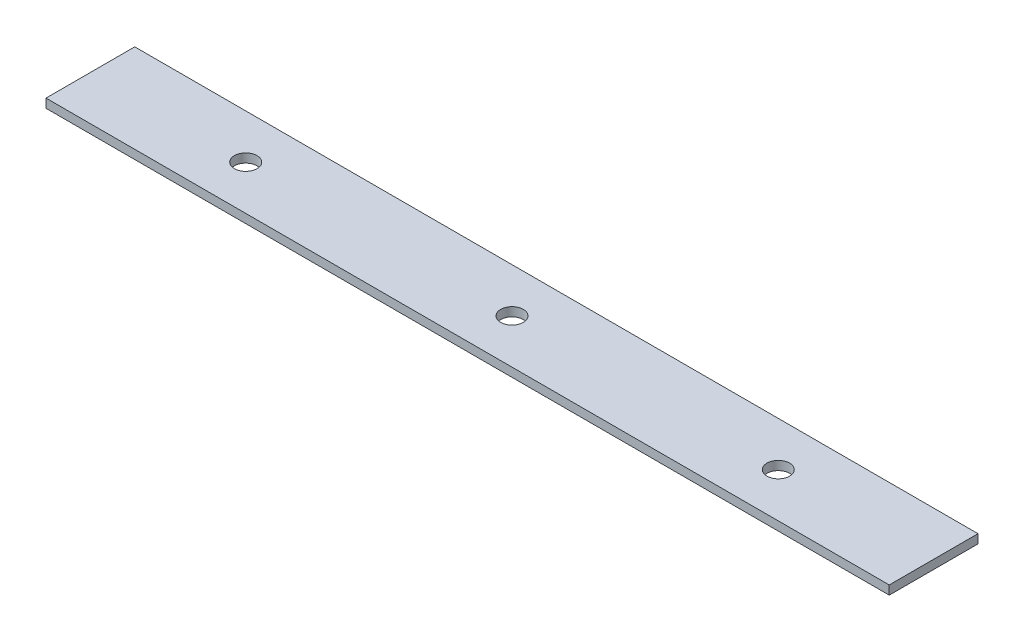
ISO-10303-21;
HEADER;
FILE_DESCRIPTION(('STEP AP214'),'2;1');
FILE_NAME('part.step','',(''),(''),'','','');
FILE_SCHEMA(('AUTOMOTIVE_DESIGN { 1 0 10303 214 1 1 1 1 }'));
ENDSEC;
DATA;
#1=APPLICATION_CONTEXT('core data for automotive mechanical design processes');
#2=APPLICATION_PROTOCOL_DEFINITION('international standard','automotive_design',2000,#1);
#3=PRODUCT_CONTEXT('',#1,'mechanical');
#4=PRODUCT('Part','Part','',(#3));
#5=PRODUCT_RELATED_PRODUCT_CATEGORY('part','',(#4));
#6=PRODUCT_DEFINITION_FORMATION('','',#4);
#7=PRODUCT_DEFINITION_CONTEXT('part definition',#1,'design');
#8=PRODUCT_DEFINITION('design','',#6,#7);
#9=PRODUCT_DEFINITION_SHAPE('','',#8);
#10=(LENGTH_UNIT() NAMED_UNIT(*) SI_UNIT(.MILLI.,.METRE.));
#11=(NAMED_UNIT(*) PLANE_ANGLE_UNIT() SI_UNIT($,.RADIAN.));
#12=(NAMED_UNIT(*) SI_UNIT($,.STERADIAN.) SOLID_ANGLE_UNIT());
#13=UNCERTAINTY_MEASURE_WITH_UNIT(LENGTH_MEASURE(1.E-05),#10,'distance_accuracy_value','');
#14=(GEOMETRIC_REPRESENTATION_CONTEXT(3) GLOBAL_UNCERTAINTY_ASSIGNED_CONTEXT((#13)) GLOBAL_UNIT_ASSIGNED_CONTEXT((#10,
#11,#12)) REPRESENTATION_CONTEXT('',''));
#15=CARTESIAN_POINT('',(0.,0.,0.));
#16=DIRECTION('',(0.,0.,1.));
#17=DIRECTION('',(1.,0.,0.));
#18=AXIS2_PLACEMENT_3D('',#15,#16,#17);
#19=CARTESIAN_POINT('',(0.,2.54,0.));
#20=DIRECTION('',(0.,-1.,0.));
#21=DIRECTION('',(0.,0.,-1.));
#22=AXIS2_PLACEMENT_3D('',#19,#20,#21);
#23=PLANE('',#22);
#24=CARTESIAN_POINT('',(120.65,2.54,-12.7));
#25=DIRECTION('',(0.,1.,0.));
#26=DIRECTION('',(0.,0.,1.));
#27=AXIS2_PLACEMENT_3D('',#24,#25,#26);
#28=CIRCLE('',#27,3.23850000000001);
#29=CARTESIAN_POINT('',(120.65,2.54,-9.46149999999999));
#30=VERTEX_POINT('',#29);
#31=EDGE_CURVE('E115',#30,#30,#28,.T.);
#32=ORIENTED_EDGE('',*,*,#31,.F.);
#33=EDGE_LOOP('',(#32));
#34=FACE_BOUND('',#33,.T.);
#35=DIRECTION('',(0.,0.,1.));
#36=VECTOR('',#35,1.);
#37=CARTESIAN_POINT('',(0.,2.54,0.));
#38=LINE('',#37,#36);
#39=CARTESIAN_POINT('',(0.,2.54,-25.4));
#40=VERTEX_POINT('',#39);
#41=CARTESIAN_POINT('',(0.,2.54,0.));
#42=VERTEX_POINT('',#41);
#43=EDGE_CURVE('E85',#40,#42,#38,.T.);
#44=ORIENTED_EDGE('',*,*,#43,.T.);
#45=DIRECTION('',(1.,0.,0.));
#46=VECTOR('',#45,1.);
#47=CARTESIAN_POINT('',(0.,2.54,0.));
#48=LINE('',#47,#46);
#49=CARTESIAN_POINT('',(241.3,2.54,0.));
#50=VERTEX_POINT('',#49);
#51=EDGE_CURVE('E80',#42,#50,#48,.T.);
#52=ORIENTED_EDGE('',*,*,#51,.T.);
#53=DIRECTION('',(0.,0.,-1.));
#54=VECTOR('',#53,1.);
#55=CARTESIAN_POINT('',(241.3,2.54,0.));
#56=LINE('',#55,#54);
#57=CARTESIAN_POINT('',(241.3,2.54,-25.4));
#58=VERTEX_POINT('',#57);
#59=EDGE_CURVE('E83',#50,#58,#56,.T.);
#60=ORIENTED_EDGE('',*,*,#59,.T.);
#61=DIRECTION('',(-1.,0.,0.));
#62=VECTOR('',#61,1.);
#63=CARTESIAN_POINT('',(0.,2.54,-25.4));
#64=LINE('',#63,#62);
#65=EDGE_CURVE('E50',#58,#40,#64,.T.);
#66=ORIENTED_EDGE('',*,*,#65,.T.);
#67=EDGE_LOOP('',(#44,#52,#60,#66));
#68=FACE_BOUND('',#67,.T.);
#69=CARTESIAN_POINT('',(196.85,2.54,-12.7));
#70=DIRECTION('',(0.,1.,0.));
#71=DIRECTION('',(0.,0.,1.));
#72=AXIS2_PLACEMENT_3D('',#69,#70,#71);
#73=CIRCLE('',#72,3.23850000000001);
#74=CARTESIAN_POINT('',(196.85,2.54,-9.46149999999999));
#75=VERTEX_POINT('',#74);
#76=EDGE_CURVE('E100',#75,#75,#73,.T.);
#77=ORIENTED_EDGE('',*,*,#76,.F.);
#78=EDGE_LOOP('',(#77));
#79=FACE_BOUND('',#78,.T.);
#80=CARTESIAN_POINT('',(44.45,2.54,-12.7));
#81=DIRECTION('',(0.,1.,0.));
#82=DIRECTION('',(0.,0.,1.));
#83=AXIS2_PLACEMENT_3D('',#80,#81,#82);
#84=CIRCLE('',#83,3.2385);
#85=CARTESIAN_POINT('',(44.45,2.54,-9.4615));
#86=VERTEX_POINT('',#85);
#87=EDGE_CURVE('E121',#86,#86,#84,.T.);
#88=ORIENTED_EDGE('',*,*,#87,.F.);
#89=EDGE_LOOP('',(#88));
#90=FACE_BOUND('',#89,.T.);
#91=ADVANCED_FACE('F33',(#34,#68,#79,#90),#23,.F.);
#92=CARTESIAN_POINT('',(0.,0.,0.));
#93=DIRECTION('',(0.,-1.,0.));
#94=DIRECTION('',(0.,0.,-1.));
#95=AXIS2_PLACEMENT_3D('',#92,#93,#94);
#96=PLANE('',#95);
#97=CARTESIAN_POINT('',(120.65,0.,-12.7));
#98=DIRECTION('',(0.,1.,0.));
#99=DIRECTION('',(0.,0.,1.));
#100=AXIS2_PLACEMENT_3D('',#97,#98,#99);
#101=CIRCLE('',#100,3.23850000000001);
#102=CARTESIAN_POINT('',(120.65,0.,-9.46149999999999));
#103=VERTEX_POINT('',#102);
#104=EDGE_CURVE('E118',#103,#103,#101,.T.);
#105=ORIENTED_EDGE('',*,*,#104,.T.);
#106=EDGE_LOOP('',(#105));
#107=FACE_BOUND('',#106,.T.);
#108=DIRECTION('',(0.,0.,1.));
#109=VECTOR('',#108,1.);
#110=CARTESIAN_POINT('',(0.,0.,0.));
#111=LINE('',#110,#109);
#112=CARTESIAN_POINT('',(0.,0.,-25.4));
#113=VERTEX_POINT('',#112);
#114=CARTESIAN_POINT('',(0.,0.,0.));
#115=VERTEX_POINT('',#114);
#116=EDGE_CURVE('E97',#113,#115,#111,.T.);
#117=ORIENTED_EDGE('',*,*,#116,.F.);
#118=DIRECTION('',(-1.,0.,0.));
#119=VECTOR('',#118,1.);
#120=CARTESIAN_POINT('',(0.,0.,-25.4));
#121=LINE('',#120,#119);
#122=CARTESIAN_POINT('',(241.3,0.,-25.4));
#123=VERTEX_POINT('',#122);
#124=EDGE_CURVE('E73',#123,#113,#121,.T.);
#125=ORIENTED_EDGE('',*,*,#124,.F.);
#126=DIRECTION('',(0.,0.,-1.));
#127=VECTOR('',#126,1.);
#128=CARTESIAN_POINT('',(241.3,0.,0.));
#129=LINE('',#128,#127);
#130=CARTESIAN_POINT('',(241.3,0.,0.));
#131=VERTEX_POINT('',#130);
#132=EDGE_CURVE('E67',#131,#123,#129,.T.);
#133=ORIENTED_EDGE('',*,*,#132,.F.);
#134=DIRECTION('',(1.,0.,0.));
#135=VECTOR('',#134,1.);
#136=CARTESIAN_POINT('',(0.,0.,0.));
#137=LINE('',#136,#135);
#138=EDGE_CURVE('E89',#115,#131,#137,.T.);
#139=ORIENTED_EDGE('',*,*,#138,.F.);
#140=EDGE_LOOP('',(#117,#125,#133,#139));
#141=FACE_BOUND('',#140,.T.);
#142=CARTESIAN_POINT('',(196.85,0.,-12.7));
#143=DIRECTION('',(0.,1.,0.));
#144=DIRECTION('',(0.,0.,1.));
#145=AXIS2_PLACEMENT_3D('',#142,#143,#144);
#146=CIRCLE('',#145,3.23850000000001);
#147=CARTESIAN_POINT('',(196.85,0.,-9.46149999999999));
#148=VERTEX_POINT('',#147);
#149=EDGE_CURVE('E112',#148,#148,#146,.T.);
#150=ORIENTED_EDGE('',*,*,#149,.T.);
#151=EDGE_LOOP('',(#150));
#152=FACE_BOUND('',#151,.T.);
#153=CARTESIAN_POINT('',(44.45,0.,-12.7));
#154=DIRECTION('',(0.,1.,0.));
#155=DIRECTION('',(0.,0.,1.));
#156=AXIS2_PLACEMENT_3D('',#153,#154,#155);
#157=CIRCLE('',#156,3.2385);
#158=CARTESIAN_POINT('',(44.45,0.,-9.4615));
#159=VERTEX_POINT('',#158);
#160=EDGE_CURVE('E124',#159,#159,#157,.T.);
#161=ORIENTED_EDGE('',*,*,#160,.T.);
#162=EDGE_LOOP('',(#161));
#163=FACE_BOUND('',#162,.T.);
#164=ADVANCED_FACE('F108',(#107,#141,#152,#163),#96,.T.);
#165=CARTESIAN_POINT('',(0.,2.54,0.));
#166=DIRECTION('',(1.,0.,0.));
#167=DIRECTION('',(0.,0.,-1.));
#168=AXIS2_PLACEMENT_3D('',#165,#166,#167);
#169=PLANE('',#168);
#170=ORIENTED_EDGE('',*,*,#116,.T.);
#171=DIRECTION('',(0.,-1.,0.));
#172=VECTOR('',#171,1.);
#173=CARTESIAN_POINT('',(0.,2.54,0.));
#174=LINE('',#173,#172);
#175=EDGE_CURVE('E11',#42,#115,#174,.T.);
#176=ORIENTED_EDGE('',*,*,#175,.F.);
#177=ORIENTED_EDGE('',*,*,#43,.F.);
#178=DIRECTION('',(0.,-1.,0.));
#179=VECTOR('',#178,1.);
#180=CARTESIAN_POINT('',(0.,2.54,-25.4));
#181=LINE('',#180,#179);
#182=EDGE_CURVE('E93',#40,#113,#181,.T.);
#183=ORIENTED_EDGE('',*,*,#182,.T.);
#184=EDGE_LOOP('',(#170,#176,#177,#183));
#185=FACE_BOUND('',#184,.T.);
#186=ADVANCED_FACE('F35',(#185),#169,.F.);
#187=CARTESIAN_POINT('',(0.,2.54,0.));
#188=DIRECTION('',(0.,0.,-1.));
#189=DIRECTION('',(-1.,0.,0.));
#190=AXIS2_PLACEMENT_3D('',#187,#188,#189);
#191=PLANE('',#190);
#192=ORIENTED_EDGE('',*,*,#138,.T.);
#193=DIRECTION('',(0.,-1.,0.));
#194=VECTOR('',#193,1.);
#195=CARTESIAN_POINT('',(241.3,2.54,0.));
#196=LINE('',#195,#194);
#197=EDGE_CURVE('E42',#50,#131,#196,.T.);
#198=ORIENTED_EDGE('',*,*,#197,.F.);
#199=ORIENTED_EDGE('',*,*,#51,.F.);
#200=ORIENTED_EDGE('',*,*,#175,.T.);
#201=EDGE_LOOP('',(#192,#198,#199,#200));
#202=FACE_BOUND('',#201,.T.);
#203=ADVANCED_FACE('F88',(#202),#191,.F.);
#204=CARTESIAN_POINT('',(241.3,2.54,0.));
#205=DIRECTION('',(-1.,0.,0.));
#206=DIRECTION('',(0.,0.,1.));
#207=AXIS2_PLACEMENT_3D('',#204,#205,#206);
#208=PLANE('',#207);
#209=ORIENTED_EDGE('',*,*,#132,.T.);
#210=DIRECTION('',(0.,-1.,0.));
#211=VECTOR('',#210,1.);
#212=CARTESIAN_POINT('',(241.3,2.54,-25.4));
#213=LINE('',#212,#211);
#214=EDGE_CURVE('E90',#58,#123,#213,.T.);
#215=ORIENTED_EDGE('',*,*,#214,.F.);
#216=ORIENTED_EDGE('',*,*,#59,.F.);
#217=ORIENTED_EDGE('',*,*,#197,.T.);
#218=EDGE_LOOP('',(#209,#215,#216,#217));
#219=FACE_BOUND('',#218,.T.);
#220=ADVANCED_FACE('F91',(#219),#208,.F.);
#221=CARTESIAN_POINT('',(0.,2.54,-25.4));
#222=DIRECTION('',(0.,0.,1.));
#223=DIRECTION('',(1.,0.,0.));
#224=AXIS2_PLACEMENT_3D('',#221,#222,#223);
#225=PLANE('',#224);
#226=ORIENTED_EDGE('',*,*,#124,.T.);
#227=ORIENTED_EDGE('',*,*,#182,.F.);
#228=ORIENTED_EDGE('',*,*,#65,.F.);
#229=ORIENTED_EDGE('',*,*,#214,.T.);
#230=EDGE_LOOP('',(#226,#227,#228,#229));
#231=FACE_BOUND('',#230,.T.);
#232=ADVANCED_FACE('F105',(#231),#225,.F.);
#233=CARTESIAN_POINT('',(196.85,2.54,-12.7));
#234=DIRECTION('',(0.,-1.,0.));
#235=DIRECTION('',(0.,0.,-1.));
#236=AXIS2_PLACEMENT_3D('',#233,#234,#235);
#237=CYLINDRICAL_SURFACE('',#236,3.23850000000001);
#238=ORIENTED_EDGE('',*,*,#76,.T.);
#239=EDGE_LOOP('',(#238));
#240=FACE_BOUND('',#239,.T.);
#241=ORIENTED_EDGE('',*,*,#149,.F.);
#242=EDGE_LOOP('',(#241));
#243=FACE_BOUND('',#242,.T.);
#244=ADVANCED_FACE('F143',(#240,#243),#237,.F.);
#245=CARTESIAN_POINT('',(120.65,2.54,-12.7));
#246=DIRECTION('',(0.,-1.,0.));
#247=DIRECTION('',(0.,0.,-1.));
#248=AXIS2_PLACEMENT_3D('',#245,#246,#247);
#249=CYLINDRICAL_SURFACE('',#248,3.23850000000001);
#250=ORIENTED_EDGE('',*,*,#31,.T.);
#251=EDGE_LOOP('',(#250));
#252=FACE_BOUND('',#251,.T.);
#253=ORIENTED_EDGE('',*,*,#104,.F.);
#254=EDGE_LOOP('',(#253));
#255=FACE_BOUND('',#254,.T.);
#256=ADVANCED_FACE('F189',(#252,#255),#249,.F.);
#257=CARTESIAN_POINT('',(44.45,2.54,-12.7));
#258=DIRECTION('',(0.,-1.,0.));
#259=DIRECTION('',(0.,0.,-1.));
#260=AXIS2_PLACEMENT_3D('',#257,#258,#259);
#261=CYLINDRICAL_SURFACE('',#260,3.2385);
#262=ORIENTED_EDGE('',*,*,#87,.T.);
#263=EDGE_LOOP('',(#262));
#264=FACE_BOUND('',#263,.T.);
#265=ORIENTED_EDGE('',*,*,#160,.F.);
#266=EDGE_LOOP('',(#265));
#267=FACE_BOUND('',#266,.T.);
#268=ADVANCED_FACE('F130',(#264,#267),#261,.F.);
#269=CLOSED_SHELL('',(#91,#164,#186,#203,#220,#232,#244,#256,#268));
#270=MANIFOLD_SOLID_BREP('B2',#269);
#271=ADVANCED_BREP_SHAPE_REPRESENTATION('',(#18,#270),#14);
#272=SHAPE_DEFINITION_REPRESENTATION(#9,#271);
ENDSEC;
END-ISO-10303-21;
